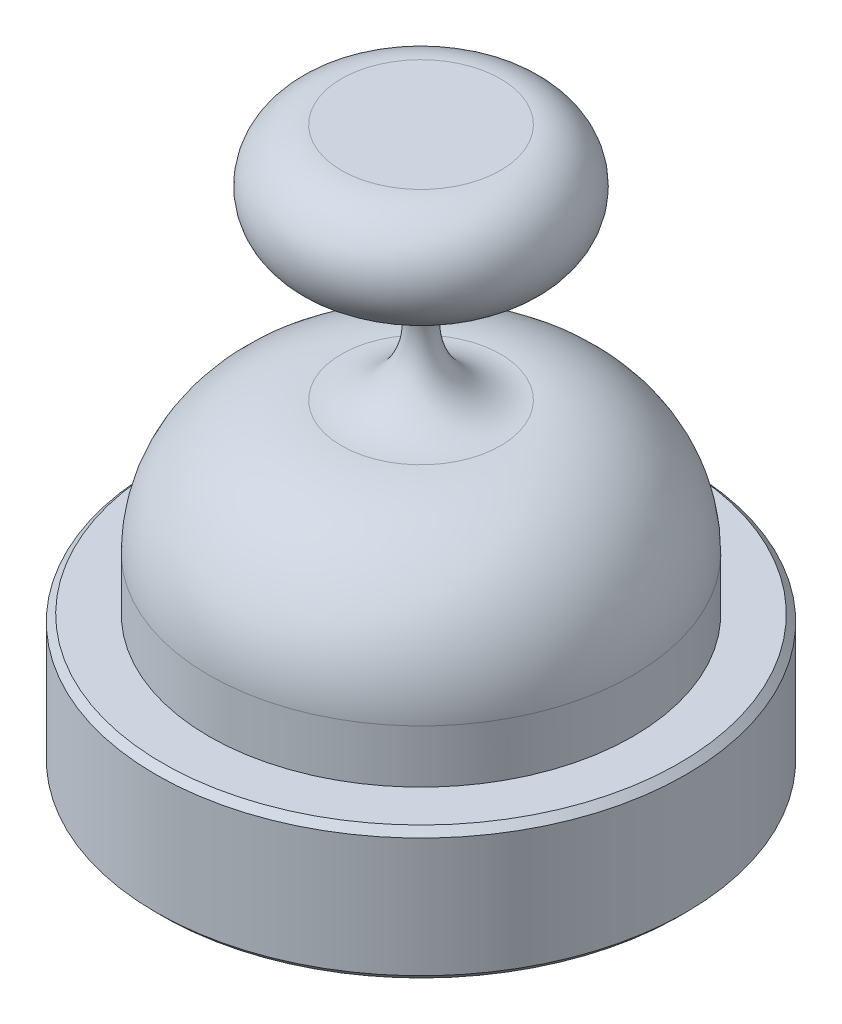
ISO-10303-21;
HEADER;
FILE_DESCRIPTION(('STEP AP214'),'2;1');
FILE_NAME('part.step','',(''),(''),'','','');
FILE_SCHEMA(('AUTOMOTIVE_DESIGN { 1 0 10303 214 1 1 1 1 }'));
ENDSEC;
DATA;
#1=APPLICATION_CONTEXT('core data for automotive mechanical design processes');
#2=APPLICATION_PROTOCOL_DEFINITION('international standard','automotive_design',2000,#1);
#3=PRODUCT_CONTEXT('',#1,'mechanical');
#4=PRODUCT('Part','Part','',(#3));
#5=PRODUCT_RELATED_PRODUCT_CATEGORY('part','',(#4));
#6=PRODUCT_DEFINITION_FORMATION('','',#4);
#7=PRODUCT_DEFINITION_CONTEXT('part definition',#1,'design');
#8=PRODUCT_DEFINITION('design','',#6,#7);
#9=PRODUCT_DEFINITION_SHAPE('','',#8);
#10=(LENGTH_UNIT() NAMED_UNIT(*) SI_UNIT(.MILLI.,.METRE.));
#11=(NAMED_UNIT(*) PLANE_ANGLE_UNIT() SI_UNIT($,.RADIAN.));
#12=(NAMED_UNIT(*) SI_UNIT($,.STERADIAN.) SOLID_ANGLE_UNIT());
#13=UNCERTAINTY_MEASURE_WITH_UNIT(LENGTH_MEASURE(1.E-05),#10,'distance_accuracy_value','');
#14=(GEOMETRIC_REPRESENTATION_CONTEXT(3) GLOBAL_UNCERTAINTY_ASSIGNED_CONTEXT((#13)) GLOBAL_UNIT_ASSIGNED_CONTEXT((#10,
#11,#12)) REPRESENTATION_CONTEXT('',''));
#15=CARTESIAN_POINT('',(0.,0.,0.));
#16=DIRECTION('',(0.,0.,1.));
#17=DIRECTION('',(1.,0.,0.));
#18=AXIS2_PLACEMENT_3D('',#15,#16,#17);
#19=CARTESIAN_POINT('',(0.,160.,0.));
#20=DIRECTION('',(0.,1.,0.));
#21=DIRECTION('',(0.,0.,1.));
#22=AXIS2_PLACEMENT_3D('',#19,#20,#21);
#23=CYLINDRICAL_SURFACE('',#22,80.);
#24=CARTESIAN_POINT('',(0.,0.,0.));
#25=DIRECTION('',(0.,-1.,0.));
#26=DIRECTION('',(0.,0.,-1.));
#27=AXIS2_PLACEMENT_3D('',#24,#25,#26);
#28=CIRCLE('',#27,80.);
#29=CARTESIAN_POINT('',(0.,0.,-80.));
#30=VERTEX_POINT('',#29);
#31=EDGE_CURVE('E61',#30,#30,#28,.F.);
#32=ORIENTED_EDGE('',*,*,#31,.T.);
#33=EDGE_LOOP('',(#32));
#34=FACE_BOUND('',#33,.T.);
#35=CARTESIAN_POINT('',(0.,20.,0.));
#36=DIRECTION('',(0.,1.,0.));
#37=DIRECTION('',(0.,0.,1.));
#38=AXIS2_PLACEMENT_3D('',#35,#36,#37);
#39=CIRCLE('',#38,80.);
#40=CARTESIAN_POINT('',(0.,20.,80.));
#41=VERTEX_POINT('',#40);
#42=EDGE_CURVE('E49',#41,#41,#39,.T.);
#43=ORIENTED_EDGE('',*,*,#42,.F.);
#44=EDGE_LOOP('',(#43));
#45=FACE_BOUND('',#44,.T.);
#46=ADVANCED_FACE('F29',(#34,#45),#23,.T.);
#47=CARTESIAN_POINT('',(0.,20.,0.));
#48=DIRECTION('',(0.,1.,0.));
#49=DIRECTION('',(0.,0.,1.));
#50=AXIS2_PLACEMENT_3D('',#47,#48,#49);
#51=DEGENERATE_TOROIDAL_SURFACE('',#50,30.,50.,.T.);
#52=ORIENTED_EDGE('',*,*,#42,.T.);
#53=EDGE_LOOP('',(#52));
#54=FACE_BOUND('',#53,.T.);
#55=CARTESIAN_POINT('',(0.,70.,0.));
#56=DIRECTION('',(0.,1.,0.));
#57=DIRECTION('',(0.,0.,1.));
#58=AXIS2_PLACEMENT_3D('',#55,#56,#57);
#59=CIRCLE('',#58,30.);
#60=CARTESIAN_POINT('',(0.,70.,30.));
#61=VERTEX_POINT('',#60);
#62=EDGE_CURVE('E52',#61,#61,#59,.T.);
#63=ORIENTED_EDGE('',*,*,#62,.F.);
#64=EDGE_LOOP('',(#63));
#65=FACE_BOUND('',#64,.T.);
#66=ADVANCED_FACE('F82',(#54,#65),#51,.T.);
#67=CARTESIAN_POINT('',(0.,95.,0.));
#68=DIRECTION('',(0.,1.,0.));
#69=DIRECTION('',(0.,0.,1.));
#70=AXIS2_PLACEMENT_3D('',#67,#68,#69);
#71=TOROIDAL_SURFACE('',#70,30.,25.);
#72=ORIENTED_EDGE('',*,*,#62,.T.);
#73=EDGE_LOOP('',(#72));
#74=FACE_BOUND('',#73,.T.);
#75=CARTESIAN_POINT('',(0.,120.,0.));
#76=DIRECTION('',(0.,1.,0.));
#77=DIRECTION('',(0.,0.,1.));
#78=AXIS2_PLACEMENT_3D('',#75,#76,#77);
#79=CIRCLE('',#78,30.);
#80=CARTESIAN_POINT('',(0.,120.,30.));
#81=VERTEX_POINT('',#80);
#82=EDGE_CURVE('E55',#81,#81,#79,.T.);
#83=ORIENTED_EDGE('',*,*,#82,.F.);
#84=EDGE_LOOP('',(#83));
#85=FACE_BOUND('',#84,.T.);
#86=ADVANCED_FACE('F87',(#74,#85),#71,.F.);
#87=CARTESIAN_POINT('',(0.,140.,0.));
#88=DIRECTION('',(0.,1.,0.));
#89=DIRECTION('',(0.,0.,1.));
#90=AXIS2_PLACEMENT_3D('',#87,#88,#89);
#91=TOROIDAL_SURFACE('',#90,30.,20.);
#92=ORIENTED_EDGE('',*,*,#82,.T.);
#93=EDGE_LOOP('',(#92));
#94=FACE_BOUND('',#93,.T.);
#95=CARTESIAN_POINT('',(0.,160.,0.));
#96=DIRECTION('',(0.,1.,0.));
#97=DIRECTION('',(0.,0.,1.));
#98=AXIS2_PLACEMENT_3D('',#95,#96,#97);
#99=CIRCLE('',#98,30.);
#100=CARTESIAN_POINT('',(0.,160.,30.));
#101=VERTEX_POINT('',#100);
#102=EDGE_CURVE('E58',#101,#101,#99,.T.);
#103=ORIENTED_EDGE('',*,*,#102,.F.);
#104=EDGE_LOOP('',(#103));
#105=FACE_BOUND('',#104,.T.);
#106=ADVANCED_FACE('F93',(#94,#105),#91,.T.);
#107=CARTESIAN_POINT('',(0.,160.,0.));
#108=DIRECTION('',(0.,1.,0.));
#109=DIRECTION('',(0.,0.,1.));
#110=AXIS2_PLACEMENT_3D('',#107,#108,#109);
#111=PLANE('',#110);
#112=ORIENTED_EDGE('',*,*,#102,.T.);
#113=EDGE_LOOP('',(#112));
#114=FACE_BOUND('',#113,.T.);
#115=ADVANCED_FACE('F97',(#114),#111,.T.);
#116=CARTESIAN_POINT('',(0.,-50.,0.));
#117=DIRECTION('',(0.,1.,0.));
#118=DIRECTION('',(0.,0.,1.));
#119=AXIS2_PLACEMENT_3D('',#116,#117,#118);
#120=CYLINDRICAL_SURFACE('',#119,100.);
#121=CARTESIAN_POINT('',(0.,-47.5,0.));
#122=DIRECTION('',(0.,-1.,0.));
#123=DIRECTION('',(0.,0.,-1.));
#124=AXIS2_PLACEMENT_3D('',#121,#122,#123);
#125=CIRCLE('',#124,100.);
#126=CARTESIAN_POINT('',(0.,-47.5,-100.));
#127=VERTEX_POINT('',#126);
#128=EDGE_CURVE('E36',#127,#127,#125,.F.);
#129=ORIENTED_EDGE('',*,*,#128,.T.);
#130=EDGE_LOOP('',(#129));
#131=FACE_BOUND('',#130,.T.);
#132=CARTESIAN_POINT('',(0.,-2.49999999999995,0.));
#133=DIRECTION('',(0.,-1.,0.));
#134=DIRECTION('',(0.,0.,-1.));
#135=AXIS2_PLACEMENT_3D('',#132,#133,#134);
#136=CIRCLE('',#135,100.);
#137=CARTESIAN_POINT('',(0.,-2.49999999999995,-100.));
#138=VERTEX_POINT('',#137);
#139=EDGE_CURVE('E40',#138,#138,#136,.T.);
#140=ORIENTED_EDGE('',*,*,#139,.T.);
#141=EDGE_LOOP('',(#140));
#142=FACE_BOUND('',#141,.T.);
#143=ADVANCED_FACE('F77',(#131,#142),#120,.T.);
#144=CARTESIAN_POINT('',(0.,-50.,0.));
#145=DIRECTION('',(0.,-1.,0.));
#146=DIRECTION('',(0.,0.,-1.));
#147=AXIS2_PLACEMENT_3D('',#144,#145,#146);
#148=PLANE('',#147);
#149=CARTESIAN_POINT('',(0.,-50.,0.));
#150=DIRECTION('',(0.,-1.,0.));
#151=DIRECTION('',(0.,0.,-1.));
#152=AXIS2_PLACEMENT_3D('',#149,#150,#151);
#153=CIRCLE('',#152,97.5);
#154=CARTESIAN_POINT('',(0.,-50.,-97.5));
#155=VERTEX_POINT('',#154);
#156=EDGE_CURVE('E44',#155,#155,#153,.T.);
#157=ORIENTED_EDGE('',*,*,#156,.T.);
#158=EDGE_LOOP('',(#157));
#159=FACE_BOUND('',#158,.T.);
#160=ADVANCED_FACE('F70',(#159),#148,.T.);
#161=CARTESIAN_POINT('',(0.,0.,0.));
#162=DIRECTION('',(0.,-1.,0.));
#163=DIRECTION('',(0.,0.,-1.));
#164=AXIS2_PLACEMENT_3D('',#161,#162,#163);
#165=PLANE('',#164);
#166=CARTESIAN_POINT('',(0.,0.,0.));
#167=DIRECTION('',(0.,-1.,0.));
#168=DIRECTION('',(0.,0.,-1.));
#169=AXIS2_PLACEMENT_3D('',#166,#167,#168);
#170=CIRCLE('',#169,97.5);
#171=CARTESIAN_POINT('',(0.,0.,-97.5));
#172=VERTEX_POINT('',#171);
#173=EDGE_CURVE('E10',#172,#172,#170,.F.);
#174=ORIENTED_EDGE('',*,*,#173,.T.);
#175=EDGE_LOOP('',(#174));
#176=FACE_BOUND('',#175,.T.);
#177=ORIENTED_EDGE('',*,*,#31,.F.);
#178=EDGE_LOOP('',(#177));
#179=FACE_BOUND('',#178,.T.);
#180=ADVANCED_FACE('F67',(#176,#179),#165,.F.);
#181=CARTESIAN_POINT('',(0.,-50.,0.));
#182=DIRECTION('',(0.,1.,0.));
#183=DIRECTION('',(0.,0.,1.));
#184=AXIS2_PLACEMENT_3D('',#181,#182,#183);
#185=CONICAL_SURFACE('',#184,97.5,0.785398163397457);
#186=ORIENTED_EDGE('',*,*,#128,.F.);
#187=EDGE_LOOP('',(#186));
#188=FACE_BOUND('',#187,.T.);
#189=ORIENTED_EDGE('',*,*,#156,.F.);
#190=EDGE_LOOP('',(#189));
#191=FACE_BOUND('',#190,.T.);
#192=ADVANCED_FACE('F69',(#188,#191),#185,.T.);
#193=CARTESIAN_POINT('',(0.,-2.49999999999995,0.));
#194=DIRECTION('',(0.,-1.,0.));
#195=DIRECTION('',(0.,0.,-1.));
#196=AXIS2_PLACEMENT_3D('',#193,#194,#195);
#197=CONICAL_SURFACE('',#196,100.,0.785398163397454);
#198=ORIENTED_EDGE('',*,*,#173,.F.);
#199=EDGE_LOOP('',(#198));
#200=FACE_BOUND('',#199,.T.);
#201=ORIENTED_EDGE('',*,*,#139,.F.);
#202=EDGE_LOOP('',(#201));
#203=FACE_BOUND('',#202,.T.);
#204=ADVANCED_FACE('F31',(#200,#203),#197,.T.);
#205=CLOSED_SHELL('',(#46,#66,#86,#106,#115,#143,#160,#180,#192,#204));
#206=MANIFOLD_SOLID_BREP('B2',#205);
#207=ADVANCED_BREP_SHAPE_REPRESENTATION('',(#18,#206),#14);
#208=SHAPE_DEFINITION_REPRESENTATION(#9,#207);
ENDSEC;
END-ISO-10303-21;
